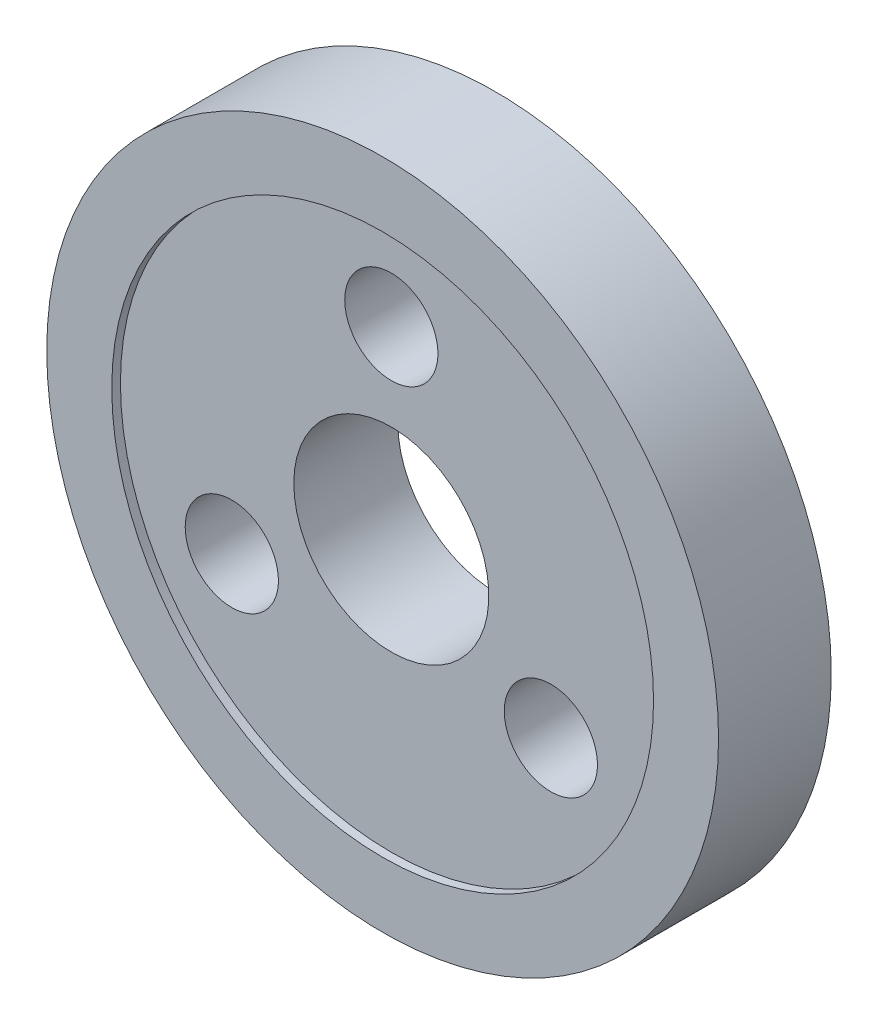
ISO-10303-21;
HEADER;
FILE_DESCRIPTION(('STEP AP214'),'2;1');
FILE_NAME('part.step','',(''),(''),'','','');
FILE_SCHEMA(('AUTOMOTIVE_DESIGN { 1 0 10303 214 1 1 1 1 }'));
ENDSEC;
DATA;
#1=APPLICATION_CONTEXT('core data for automotive mechanical design processes');
#2=APPLICATION_PROTOCOL_DEFINITION('international standard','automotive_design',2000,#1);
#3=PRODUCT_CONTEXT('',#1,'mechanical');
#4=PRODUCT('Part','Part','',(#3));
#5=PRODUCT_RELATED_PRODUCT_CATEGORY('part','',(#4));
#6=PRODUCT_DEFINITION_FORMATION('','',#4);
#7=PRODUCT_DEFINITION_CONTEXT('part definition',#1,'design');
#8=PRODUCT_DEFINITION('design','',#6,#7);
#9=PRODUCT_DEFINITION_SHAPE('','',#8);
#10=(LENGTH_UNIT() NAMED_UNIT(*) SI_UNIT(.MILLI.,.METRE.));
#11=(NAMED_UNIT(*) PLANE_ANGLE_UNIT() SI_UNIT($,.RADIAN.));
#12=(NAMED_UNIT(*) SI_UNIT($,.STERADIAN.) SOLID_ANGLE_UNIT());
#13=UNCERTAINTY_MEASURE_WITH_UNIT(LENGTH_MEASURE(1.E-05),#10,'distance_accuracy_value','');
#14=(GEOMETRIC_REPRESENTATION_CONTEXT(3) GLOBAL_UNCERTAINTY_ASSIGNED_CONTEXT((#13)) GLOBAL_UNIT_ASSIGNED_CONTEXT((#10,
#11,#12)) REPRESENTATION_CONTEXT('',''));
#15=CARTESIAN_POINT('',(0.,0.,0.));
#16=DIRECTION('',(0.,0.,1.));
#17=DIRECTION('',(1.,0.,0.));
#18=AXIS2_PLACEMENT_3D('',#15,#16,#17);
#19=CARTESIAN_POINT('',(0.,0.,0.4));
#20=DIRECTION('',(0.,0.,1.));
#21=DIRECTION('',(1.,0.,0.));
#22=AXIS2_PLACEMENT_3D('',#19,#20,#21);
#23=PLANE('',#22);
#24=CARTESIAN_POINT('',(0.,0.,0.4));
#25=DIRECTION('',(0.,0.,1.));
#26=DIRECTION('',(1.,0.,0.));
#27=AXIS2_PLACEMENT_3D('',#24,#25,#26);
#28=CIRCLE('',#27,15.5);
#29=CARTESIAN_POINT('',(15.5,0.,0.4));
#30=VERTEX_POINT('',#29);
#31=EDGE_CURVE('E10',#30,#30,#28,.T.);
#32=ORIENTED_EDGE('',*,*,#31,.T.);
#33=EDGE_LOOP('',(#32));
#34=FACE_BOUND('',#33,.T.);
#35=CARTESIAN_POINT('',(0.,0.,0.4));
#36=DIRECTION('',(0.,0.,1.));
#37=DIRECTION('',(1.,0.,0.));
#38=AXIS2_PLACEMENT_3D('',#35,#36,#37);
#39=CIRCLE('',#38,12.5);
#40=CARTESIAN_POINT('',(12.5,0.,0.4));
#41=VERTEX_POINT('',#40);
#42=EDGE_CURVE('E49',#41,#41,#39,.T.);
#43=ORIENTED_EDGE('',*,*,#42,.F.);
#44=EDGE_LOOP('',(#43));
#45=FACE_BOUND('',#44,.T.);
#46=ADVANCED_FACE('F41',(#34,#45),#23,.T.);
#47=CARTESIAN_POINT('',(0.,0.,0.4));
#48=DIRECTION('',(0.,0.,-1.));
#49=DIRECTION('',(-1.,0.,0.));
#50=AXIS2_PLACEMENT_3D('',#47,#48,#49);
#51=CYLINDRICAL_SURFACE('',#50,15.5);
#52=ORIENTED_EDGE('',*,*,#31,.F.);
#53=EDGE_LOOP('',(#52));
#54=FACE_BOUND('',#53,.T.);
#55=CARTESIAN_POINT('',(0.,0.,-4.8));
#56=DIRECTION('',(0.,0.,-1.));
#57=DIRECTION('',(-1.,0.,0.));
#58=AXIS2_PLACEMENT_3D('',#55,#56,#57);
#59=CIRCLE('',#58,15.5);
#60=CARTESIAN_POINT('',(-15.5,0.,-4.8));
#61=VERTEX_POINT('',#60);
#62=EDGE_CURVE('E80',#61,#61,#59,.T.);
#63=ORIENTED_EDGE('',*,*,#62,.F.);
#64=EDGE_LOOP('',(#63));
#65=FACE_BOUND('',#64,.T.);
#66=ADVANCED_FACE('F43',(#54,#65),#51,.T.);
#67=CARTESIAN_POINT('',(0.,0.,0.4));
#68=DIRECTION('',(0.,0.,-1.));
#69=DIRECTION('',(-1.,0.,0.));
#70=AXIS2_PLACEMENT_3D('',#67,#68,#69);
#71=CYLINDRICAL_SURFACE('',#70,12.5);
#72=ORIENTED_EDGE('',*,*,#42,.T.);
#73=EDGE_LOOP('',(#72));
#74=FACE_BOUND('',#73,.T.);
#75=CARTESIAN_POINT('',(0.,0.,0.));
#76=DIRECTION('',(0.,0.,1.));
#77=DIRECTION('',(1.,0.,0.));
#78=AXIS2_PLACEMENT_3D('',#75,#76,#77);
#79=CIRCLE('',#78,12.5);
#80=CARTESIAN_POINT('',(12.5,0.,0.));
#81=VERTEX_POINT('',#80);
#82=EDGE_CURVE('E54',#81,#81,#79,.T.);
#83=ORIENTED_EDGE('',*,*,#82,.F.);
#84=EDGE_LOOP('',(#83));
#85=FACE_BOUND('',#84,.T.);
#86=ADVANCED_FACE('F91',(#74,#85),#71,.F.);
#87=CARTESIAN_POINT('',(0.,0.,0.));
#88=DIRECTION('',(0.,0.,-1.));
#89=DIRECTION('',(-1.,0.,0.));
#90=AXIS2_PLACEMENT_3D('',#87,#88,#89);
#91=PLANE('',#90);
#92=CARTESIAN_POINT('',(0.,8.5,0.));
#93=DIRECTION('',(0.,0.,-1.));
#94=DIRECTION('',(-1.,0.,0.));
#95=AXIS2_PLACEMENT_3D('',#92,#93,#94);
#96=CIRCLE('',#95,2.15);
#97=CARTESIAN_POINT('',(-2.15,8.5,0.));
#98=VERTEX_POINT('',#97);
#99=EDGE_CURVE('E45',#98,#98,#96,.T.);
#100=ORIENTED_EDGE('',*,*,#99,.T.);
#101=EDGE_LOOP('',(#100));
#102=FACE_BOUND('',#101,.T.);
#103=CARTESIAN_POINT('',(-7.36121593216774,-4.24999999999998,0.));
#104=DIRECTION('',(0.,0.,-1.));
#105=DIRECTION('',(-1.,0.,0.));
#106=AXIS2_PLACEMENT_3D('',#103,#104,#105);
#107=CIRCLE('',#106,2.15);
#108=CARTESIAN_POINT('',(-9.51121593216774,-4.24999999999998,0.));
#109=VERTEX_POINT('',#108);
#110=EDGE_CURVE('E57',#109,#109,#107,.T.);
#111=ORIENTED_EDGE('',*,*,#110,.T.);
#112=EDGE_LOOP('',(#111));
#113=FACE_BOUND('',#112,.T.);
#114=CARTESIAN_POINT('',(7.36121593216771,-4.25000000000004,0.));
#115=DIRECTION('',(0.,0.,-1.));
#116=DIRECTION('',(-1.,0.,0.));
#117=AXIS2_PLACEMENT_3D('',#114,#115,#116);
#118=CIRCLE('',#117,2.15);
#119=CARTESIAN_POINT('',(5.21121593216771,-4.25000000000004,0.));
#120=VERTEX_POINT('',#119);
#121=EDGE_CURVE('E64',#120,#120,#118,.T.);
#122=ORIENTED_EDGE('',*,*,#121,.T.);
#123=EDGE_LOOP('',(#122));
#124=FACE_BOUND('',#123,.T.);
#125=CARTESIAN_POINT('',(0.,0.,0.));
#126=DIRECTION('',(0.,0.,-1.));
#127=DIRECTION('',(-1.,0.,0.));
#128=AXIS2_PLACEMENT_3D('',#125,#126,#127);
#129=CIRCLE('',#128,4.5);
#130=CARTESIAN_POINT('',(-4.5,0.,0.));
#131=VERTEX_POINT('',#130);
#132=EDGE_CURVE('E76',#131,#131,#129,.T.);
#133=ORIENTED_EDGE('',*,*,#132,.T.);
#134=EDGE_LOOP('',(#133));
#135=FACE_BOUND('',#134,.T.);
#136=ORIENTED_EDGE('',*,*,#82,.T.);
#137=EDGE_LOOP('',(#136));
#138=FACE_BOUND('',#137,.T.);
#139=ADVANCED_FACE('F89',(#102,#113,#124,#135,#138),#91,.F.);
#140=CARTESIAN_POINT('',(0.,0.,-4.8));
#141=DIRECTION('',(0.,0.,-1.));
#142=DIRECTION('',(-1.,0.,0.));
#143=AXIS2_PLACEMENT_3D('',#140,#141,#142);
#144=PLANE('',#143);
#145=CARTESIAN_POINT('',(0.,8.5,-4.8));
#146=DIRECTION('',(0.,0.,-1.));
#147=DIRECTION('',(-1.,0.,0.));
#148=AXIS2_PLACEMENT_3D('',#145,#146,#147);
#149=CIRCLE('',#148,2.15);
#150=CARTESIAN_POINT('',(-2.15,8.5,-4.8));
#151=VERTEX_POINT('',#150);
#152=EDGE_CURVE('E71',#151,#151,#149,.T.);
#153=ORIENTED_EDGE('',*,*,#152,.F.);
#154=EDGE_LOOP('',(#153));
#155=FACE_BOUND('',#154,.T.);
#156=CARTESIAN_POINT('',(-7.36121593216774,-4.24999999999998,-4.8));
#157=DIRECTION('',(0.,0.,-1.));
#158=DIRECTION('',(-1.,0.,0.));
#159=AXIS2_PLACEMENT_3D('',#156,#157,#158);
#160=CIRCLE('',#159,2.15);
#161=CARTESIAN_POINT('',(-9.51121593216774,-4.24999999999998,-4.8));
#162=VERTEX_POINT('',#161);
#163=EDGE_CURVE('E60',#162,#162,#160,.T.);
#164=ORIENTED_EDGE('',*,*,#163,.F.);
#165=EDGE_LOOP('',(#164));
#166=FACE_BOUND('',#165,.T.);
#167=CARTESIAN_POINT('',(7.36121593216771,-4.25000000000004,-4.8));
#168=DIRECTION('',(0.,0.,-1.));
#169=DIRECTION('',(-1.,0.,0.));
#170=AXIS2_PLACEMENT_3D('',#167,#168,#169);
#171=CIRCLE('',#170,2.15);
#172=CARTESIAN_POINT('',(5.21121593216771,-4.25000000000004,-4.8));
#173=VERTEX_POINT('',#172);
#174=EDGE_CURVE('E59',#173,#173,#171,.T.);
#175=ORIENTED_EDGE('',*,*,#174,.F.);
#176=EDGE_LOOP('',(#175));
#177=FACE_BOUND('',#176,.T.);
#178=ORIENTED_EDGE('',*,*,#62,.T.);
#179=EDGE_LOOP('',(#178));
#180=FACE_BOUND('',#179,.T.);
#181=CARTESIAN_POINT('',(0.,0.,-4.8));
#182=DIRECTION('',(0.,0.,-1.));
#183=DIRECTION('',(-1.,0.,0.));
#184=AXIS2_PLACEMENT_3D('',#181,#182,#183);
#185=CIRCLE('',#184,4.5);
#186=CARTESIAN_POINT('',(-4.5,0.,-4.8));
#187=VERTEX_POINT('',#186);
#188=EDGE_CURVE('E77',#187,#187,#185,.T.);
#189=ORIENTED_EDGE('',*,*,#188,.F.);
#190=EDGE_LOOP('',(#189));
#191=FACE_BOUND('',#190,.T.);
#192=ADVANCED_FACE('F99',(#155,#166,#177,#180,#191),#144,.T.);
#193=CARTESIAN_POINT('',(0.,0.,-4.8));
#194=DIRECTION('',(0.,0.,1.));
#195=DIRECTION('',(1.,0.,0.));
#196=AXIS2_PLACEMENT_3D('',#193,#194,#195);
#197=CYLINDRICAL_SURFACE('',#196,4.5);
#198=ORIENTED_EDGE('',*,*,#188,.T.);
#199=EDGE_LOOP('',(#198));
#200=FACE_BOUND('',#199,.T.);
#201=ORIENTED_EDGE('',*,*,#132,.F.);
#202=EDGE_LOOP('',(#201));
#203=FACE_BOUND('',#202,.T.);
#204=ADVANCED_FACE('F132',(#200,#203),#197,.F.);
#205=CARTESIAN_POINT('',(7.36121593216771,-4.25000000000004,-4.8));
#206=DIRECTION('',(0.,0.,-1.));
#207=DIRECTION('',(-1.,0.,0.));
#208=AXIS2_PLACEMENT_3D('',#205,#206,#207);
#209=CYLINDRICAL_SURFACE('',#208,2.15);
#210=ORIENTED_EDGE('',*,*,#174,.T.);
#211=EDGE_LOOP('',(#210));
#212=FACE_BOUND('',#211,.T.);
#213=ORIENTED_EDGE('',*,*,#121,.F.);
#214=EDGE_LOOP('',(#213));
#215=FACE_BOUND('',#214,.T.);
#216=ADVANCED_FACE('F142',(#212,#215),#209,.F.);
#217=CARTESIAN_POINT('',(-7.36121593216774,-4.24999999999998,-4.8));
#218=DIRECTION('',(0.,0.,-1.));
#219=DIRECTION('',(-1.,0.,0.));
#220=AXIS2_PLACEMENT_3D('',#217,#218,#219);
#221=CYLINDRICAL_SURFACE('',#220,2.15);
#222=ORIENTED_EDGE('',*,*,#163,.T.);
#223=EDGE_LOOP('',(#222));
#224=FACE_BOUND('',#223,.T.);
#225=ORIENTED_EDGE('',*,*,#110,.F.);
#226=EDGE_LOOP('',(#225));
#227=FACE_BOUND('',#226,.T.);
#228=ADVANCED_FACE('F151',(#224,#227),#221,.F.);
#229=CARTESIAN_POINT('',(0.,8.5,-4.8));
#230=DIRECTION('',(0.,0.,-1.));
#231=DIRECTION('',(-1.,0.,0.));
#232=AXIS2_PLACEMENT_3D('',#229,#230,#231);
#233=CYLINDRICAL_SURFACE('',#232,2.15);
#234=ORIENTED_EDGE('',*,*,#152,.T.);
#235=EDGE_LOOP('',(#234));
#236=FACE_BOUND('',#235,.T.);
#237=ORIENTED_EDGE('',*,*,#99,.F.);
#238=EDGE_LOOP('',(#237));
#239=FACE_BOUND('',#238,.T.);
#240=ADVANCED_FACE('F161',(#236,#239),#233,.F.);
#241=CLOSED_SHELL('',(#46,#66,#86,#139,#192,#204,#216,#228,#240));
#242=MANIFOLD_SOLID_BREP('B2',#241);
#243=ADVANCED_BREP_SHAPE_REPRESENTATION('',(#18,#242),#14);
#244=SHAPE_DEFINITION_REPRESENTATION(#9,#243);
ENDSEC;
END-ISO-10303-21;
